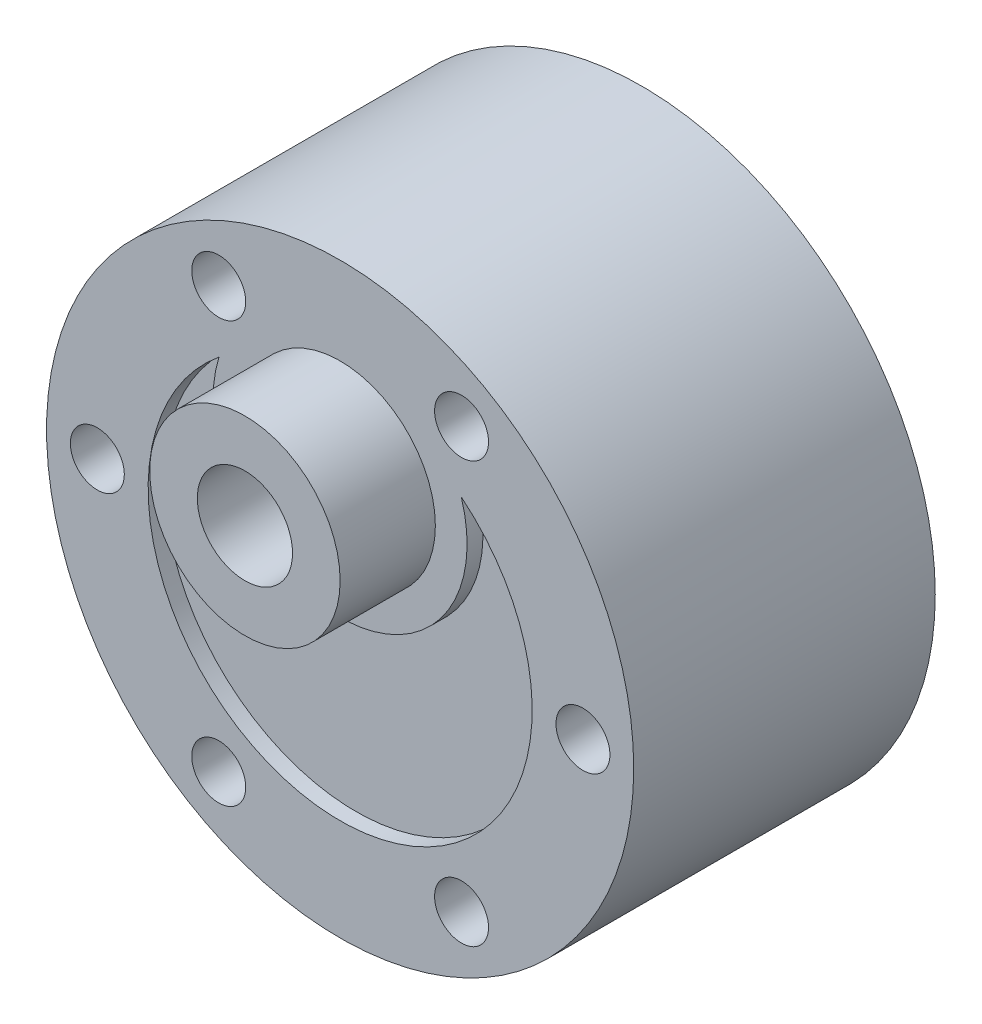
ISO-10303-21;
HEADER;
FILE_DESCRIPTION(('STEP AP214'),'2;1');
FILE_NAME('part.step','',(''),(''),'','','');
FILE_SCHEMA(('AUTOMOTIVE_DESIGN { 1 0 10303 214 1 1 1 1 }'));
ENDSEC;
DATA;
#1=APPLICATION_CONTEXT('core data for automotive mechanical design processes');
#2=APPLICATION_PROTOCOL_DEFINITION('international standard','automotive_design',2000,#1);
#3=PRODUCT_CONTEXT('',#1,'mechanical');
#4=PRODUCT('Part','Part','',(#3));
#5=PRODUCT_RELATED_PRODUCT_CATEGORY('part','',(#4));
#6=PRODUCT_DEFINITION_FORMATION('','',#4);
#7=PRODUCT_DEFINITION_CONTEXT('part definition',#1,'design');
#8=PRODUCT_DEFINITION('design','',#6,#7);
#9=PRODUCT_DEFINITION_SHAPE('','',#8);
#10=(LENGTH_UNIT() NAMED_UNIT(*) SI_UNIT(.MILLI.,.METRE.));
#11=(NAMED_UNIT(*) PLANE_ANGLE_UNIT() SI_UNIT($,.RADIAN.));
#12=(NAMED_UNIT(*) SI_UNIT($,.STERADIAN.) SOLID_ANGLE_UNIT());
#13=UNCERTAINTY_MEASURE_WITH_UNIT(LENGTH_MEASURE(1.E-05),#10,'distance_accuracy_value','');
#14=(GEOMETRIC_REPRESENTATION_CONTEXT(3) GLOBAL_UNCERTAINTY_ASSIGNED_CONTEXT((#13)) GLOBAL_UNIT_ASSIGNED_CONTEXT((#10,
#11,#12)) REPRESENTATION_CONTEXT('',''));
#15=CARTESIAN_POINT('',(0.,0.,0.));
#16=DIRECTION('',(0.,0.,1.));
#17=DIRECTION('',(1.,0.,0.));
#18=AXIS2_PLACEMENT_3D('',#15,#16,#17);
#19=CARTESIAN_POINT('',(0.,0.,12.));
#20=DIRECTION('',(0.,0.,-1.));
#21=DIRECTION('',(-1.,0.,0.));
#22=AXIS2_PLACEMENT_3D('',#19,#20,#21);
#23=CYLINDRICAL_SURFACE('',#22,18.);
#24=CARTESIAN_POINT('',(0.,0.,12.));
#25=DIRECTION('',(0.,0.,-1.));
#26=DIRECTION('',(-1.,0.,0.));
#27=AXIS2_PLACEMENT_3D('',#24,#25,#26);
#28=CIRCLE('',#27,18.);
#29=CARTESIAN_POINT('',(-18.,0.,12.));
#30=VERTEX_POINT('',#29);
#31=EDGE_CURVE('E133',#30,#30,#28,.T.);
#32=ORIENTED_EDGE('',*,*,#31,.F.);
#33=EDGE_LOOP('',(#32));
#34=FACE_BOUND('',#33,.T.);
#35=CARTESIAN_POINT('',(0.,0.,0.5));
#36=DIRECTION('',(0.,0.,-1.));
#37=DIRECTION('',(-1.,0.,0.));
#38=AXIS2_PLACEMENT_3D('',#35,#36,#37);
#39=CIRCLE('',#38,18.);
#40=CARTESIAN_POINT('',(-18.,0.,0.5));
#41=VERTEX_POINT('',#40);
#42=EDGE_CURVE('E42',#41,#41,#39,.F.);
#43=ORIENTED_EDGE('',*,*,#42,.F.);
#44=EDGE_LOOP('',(#43));
#45=FACE_BOUND('',#44,.T.);
#46=ADVANCED_FACE('F34',(#34,#45),#23,.F.);
#47=CARTESIAN_POINT('',(15.3,-1.57973634173914E-13,13.));
#48=DIRECTION('',(0.,0.,1.));
#49=DIRECTION('',(1.,0.,0.));
#50=AXIS2_PLACEMENT_3D('',#47,#48,#49);
#51=CONICAL_SURFACE('',#50,1.69999999999999,1.02974425867665);
#52=CARTESIAN_POINT('',(15.3,-1.57973634173914E-13,13.));
#53=DIRECTION('',(0.,0.,1.));
#54=DIRECTION('',(1.,0.,0.));
#55=AXIS2_PLACEMENT_3D('',#52,#53,#54);
#56=CIRCLE('',#55,1.69999999999999);
#57=CARTESIAN_POINT('',(17.,-1.57973634173914E-13,13.));
#58=VERTEX_POINT('',#57);
#59=EDGE_CURVE('E181',#58,#58,#56,.T.);
#60=ORIENTED_EDGE('',*,*,#59,.T.);
#61=EDGE_LOOP('',(#60));
#62=FACE_BOUND('',#61,.T.);
#63=CARTESIAN_POINT('',(15.3,-1.57973634173914E-13,12.));
#64=DIRECTION('',(0.,0.,-1.));
#65=DIRECTION('',(-1.,0.,0.));
#66=AXIS2_PLACEMENT_3D('',#63,#64,#65);
#67=CIRCLE('',#66,0.0357205176494769);
#68=CARTESIAN_POINT('',(15.2642794823505,-1.57973634173914E-13,12.));
#69=VERTEX_POINT('',#68);
#70=EDGE_CURVE('E151',#69,#69,#67,.F.);
#71=ORIENTED_EDGE('',*,*,#70,.F.);
#72=EDGE_LOOP('',(#71));
#73=FACE_BOUND('',#72,.T.);
#74=ADVANCED_FACE('F251',(#62,#73),#51,.F.);
#75=CARTESIAN_POINT('',(-7.65000000000012,13.2501886779018,13.));
#76=DIRECTION('',(0.,0.,1.));
#77=DIRECTION('',(1.,0.,0.));
#78=AXIS2_PLACEMENT_3D('',#75,#76,#77);
#79=CONICAL_SURFACE('',#78,1.69999999999999,1.02974425867665);
#80=CARTESIAN_POINT('',(-7.65000000000012,13.2501886779018,13.));
#81=DIRECTION('',(0.,0.,1.));
#82=DIRECTION('',(1.,0.,0.));
#83=AXIS2_PLACEMENT_3D('',#80,#81,#82);
#84=CIRCLE('',#83,1.69999999999999);
#85=CARTESIAN_POINT('',(-5.95000000000013,13.2501886779018,13.));
#86=VERTEX_POINT('',#85);
#87=EDGE_CURVE('E175',#86,#86,#84,.T.);
#88=ORIENTED_EDGE('',*,*,#87,.T.);
#89=EDGE_LOOP('',(#88));
#90=FACE_BOUND('',#89,.T.);
#91=CARTESIAN_POINT('',(-7.65000000000012,13.2501886779018,12.));
#92=DIRECTION('',(0.,0.,-1.));
#93=DIRECTION('',(-1.,0.,0.));
#94=AXIS2_PLACEMENT_3D('',#91,#92,#93);
#95=CIRCLE('',#94,0.0357205176494769);
#96=CARTESIAN_POINT('',(-7.6857205176496,13.2501886779018,12.));
#97=VERTEX_POINT('',#96);
#98=EDGE_CURVE('E148',#97,#97,#95,.F.);
#99=ORIENTED_EDGE('',*,*,#98,.F.);
#100=EDGE_LOOP('',(#99));
#101=FACE_BOUND('',#100,.T.);
#102=ADVANCED_FACE('F257',(#90,#101),#79,.F.);
#103=CARTESIAN_POINT('',(-15.3,0.,13.));
#104=DIRECTION('',(0.,0.,1.));
#105=DIRECTION('',(1.,0.,0.));
#106=AXIS2_PLACEMENT_3D('',#103,#104,#105);
#107=CONICAL_SURFACE('',#106,1.69999999999999,1.02974425867665);
#108=CARTESIAN_POINT('',(-15.3,0.,13.));
#109=DIRECTION('',(0.,0.,1.));
#110=DIRECTION('',(1.,0.,0.));
#111=AXIS2_PLACEMENT_3D('',#108,#109,#110);
#112=CIRCLE('',#111,1.69999999999999);
#113=CARTESIAN_POINT('',(-13.6,0.,13.));
#114=VERTEX_POINT('',#113);
#115=EDGE_CURVE('E169',#114,#114,#112,.T.);
#116=ORIENTED_EDGE('',*,*,#115,.T.);
#117=EDGE_LOOP('',(#116));
#118=FACE_BOUND('',#117,.T.);
#119=CARTESIAN_POINT('',(-15.3,0.,12.));
#120=DIRECTION('',(0.,0.,-1.));
#121=DIRECTION('',(-1.,0.,0.));
#122=AXIS2_PLACEMENT_3D('',#119,#120,#121);
#123=CIRCLE('',#122,0.0357205176494769);
#124=CARTESIAN_POINT('',(-15.3357205176495,0.,12.));
#125=VERTEX_POINT('',#124);
#126=EDGE_CURVE('E145',#125,#125,#123,.F.);
#127=ORIENTED_EDGE('',*,*,#126,.F.);
#128=EDGE_LOOP('',(#127));
#129=FACE_BOUND('',#128,.T.);
#130=ADVANCED_FACE('F282',(#118,#129),#107,.F.);
#131=CARTESIAN_POINT('',(-7.64999999999992,-13.250188677902,13.));
#132=DIRECTION('',(0.,0.,1.));
#133=DIRECTION('',(1.,0.,0.));
#134=AXIS2_PLACEMENT_3D('',#131,#132,#133);
#135=CONICAL_SURFACE('',#134,1.69999999999999,1.02974425867665);
#136=CARTESIAN_POINT('',(-7.64999999999992,-13.250188677902,13.));
#137=DIRECTION('',(0.,0.,1.));
#138=DIRECTION('',(1.,0.,0.));
#139=AXIS2_PLACEMENT_3D('',#136,#137,#138);
#140=CIRCLE('',#139,1.69999999999999);
#141=CARTESIAN_POINT('',(-5.94999999999992,-13.250188677902,13.));
#142=VERTEX_POINT('',#141);
#143=EDGE_CURVE('E163',#142,#142,#140,.T.);
#144=ORIENTED_EDGE('',*,*,#143,.T.);
#145=EDGE_LOOP('',(#144));
#146=FACE_BOUND('',#145,.T.);
#147=CARTESIAN_POINT('',(-7.64999999999992,-13.250188677902,12.));
#148=DIRECTION('',(0.,0.,-1.));
#149=DIRECTION('',(-1.,0.,0.));
#150=AXIS2_PLACEMENT_3D('',#147,#148,#149);
#151=CIRCLE('',#150,0.0357205176494769);
#152=CARTESIAN_POINT('',(-7.68572051764939,-13.250188677902,12.));
#153=VERTEX_POINT('',#152);
#154=EDGE_CURVE('E142',#153,#153,#151,.F.);
#155=ORIENTED_EDGE('',*,*,#154,.F.);
#156=EDGE_LOOP('',(#155));
#157=FACE_BOUND('',#156,.T.);
#158=ADVANCED_FACE('F274',(#146,#157),#135,.F.);
#159=CARTESIAN_POINT('',(7.64999999999992,-13.250188677902,13.));
#160=DIRECTION('',(0.,0.,1.));
#161=DIRECTION('',(1.,0.,0.));
#162=AXIS2_PLACEMENT_3D('',#159,#160,#161);
#163=CONICAL_SURFACE('',#162,1.69999999999999,1.02974425867665);
#164=CARTESIAN_POINT('',(7.64999999999992,-13.250188677902,13.));
#165=DIRECTION('',(0.,0.,1.));
#166=DIRECTION('',(1.,0.,0.));
#167=AXIS2_PLACEMENT_3D('',#164,#165,#166);
#168=CIRCLE('',#167,1.69999999999999);
#169=CARTESIAN_POINT('',(9.34999999999992,-13.250188677902,13.));
#170=VERTEX_POINT('',#169);
#171=EDGE_CURVE('E157',#170,#170,#168,.T.);
#172=ORIENTED_EDGE('',*,*,#171,.T.);
#173=EDGE_LOOP('',(#172));
#174=FACE_BOUND('',#173,.T.);
#175=CARTESIAN_POINT('',(7.64999999999992,-13.250188677902,12.));
#176=DIRECTION('',(0.,0.,-1.));
#177=DIRECTION('',(-1.,0.,0.));
#178=AXIS2_PLACEMENT_3D('',#175,#176,#177);
#179=CIRCLE('',#178,0.0357205176494769);
#180=CARTESIAN_POINT('',(7.61427948235045,-13.250188677902,12.));
#181=VERTEX_POINT('',#180);
#182=EDGE_CURVE('E141',#181,#181,#179,.F.);
#183=ORIENTED_EDGE('',*,*,#182,.F.);
#184=EDGE_LOOP('',(#183));
#185=FACE_BOUND('',#184,.T.);
#186=ADVANCED_FACE('F271',(#174,#185),#163,.F.);
#187=CARTESIAN_POINT('',(0.,0.,19.));
#188=DIRECTION('',(0.,0.,-1.));
#189=DIRECTION('',(-1.,0.,0.));
#190=AXIS2_PLACEMENT_3D('',#187,#188,#189);
#191=CYLINDRICAL_SURFACE('',#190,18.5);
#192=CARTESIAN_POINT('',(0.,0.,19.));
#193=DIRECTION('',(0.,0.,1.));
#194=DIRECTION('',(1.,0.,0.));
#195=AXIS2_PLACEMENT_3D('',#192,#193,#194);
#196=CIRCLE('',#195,18.5);
#197=CARTESIAN_POINT('',(18.5,0.,19.));
#198=VERTEX_POINT('',#197);
#199=EDGE_CURVE('E208',#198,#198,#196,.T.);
#200=ORIENTED_EDGE('',*,*,#199,.F.);
#201=EDGE_LOOP('',(#200));
#202=FACE_BOUND('',#201,.T.);
#203=CARTESIAN_POINT('',(0.,0.,0.));
#204=DIRECTION('',(0.,0.,1.));
#205=DIRECTION('',(1.,0.,0.));
#206=AXIS2_PLACEMENT_3D('',#203,#204,#205);
#207=CIRCLE('',#206,18.5);
#208=CARTESIAN_POINT('',(18.5,0.,0.));
#209=VERTEX_POINT('',#208);
#210=EDGE_CURVE('E205',#209,#209,#207,.T.);
#211=ORIENTED_EDGE('',*,*,#210,.T.);
#212=EDGE_LOOP('',(#211));
#213=FACE_BOUND('',#212,.T.);
#214=ADVANCED_FACE('F36',(#202,#213),#191,.T.);
#215=CARTESIAN_POINT('',(0.,0.,19.));
#216=DIRECTION('',(0.,0.,1.));
#217=DIRECTION('',(1.,0.,0.));
#218=AXIS2_PLACEMENT_3D('',#215,#216,#217);
#219=PLANE('',#218);
#220=CARTESIAN_POINT('',(7.64999999999992,-13.250188677902,19.));
#221=DIRECTION('',(0.,0.,1.));
#222=DIRECTION('',(1.,0.,0.));
#223=AXIS2_PLACEMENT_3D('',#220,#221,#222);
#224=CIRCLE('',#223,1.69999999999999);
#225=CARTESIAN_POINT('',(9.34999999999991,-13.250188677902,19.));
#226=VERTEX_POINT('',#225);
#227=EDGE_CURVE('E154',#226,#226,#224,.T.);
#228=ORIENTED_EDGE('',*,*,#227,.F.);
#229=EDGE_LOOP('',(#228));
#230=FACE_BOUND('',#229,.T.);
#231=CARTESIAN_POINT('',(-7.64999999999992,-13.250188677902,19.));
#232=DIRECTION('',(0.,0.,1.));
#233=DIRECTION('',(1.,0.,0.));
#234=AXIS2_PLACEMENT_3D('',#231,#232,#233);
#235=CIRCLE('',#234,1.69999999999999);
#236=CARTESIAN_POINT('',(-5.94999999999993,-13.250188677902,19.));
#237=VERTEX_POINT('',#236);
#238=EDGE_CURVE('E160',#237,#237,#235,.T.);
#239=ORIENTED_EDGE('',*,*,#238,.F.);
#240=EDGE_LOOP('',(#239));
#241=FACE_BOUND('',#240,.T.);
#242=CARTESIAN_POINT('',(-15.3,0.,19.));
#243=DIRECTION('',(0.,0.,1.));
#244=DIRECTION('',(1.,0.,0.));
#245=AXIS2_PLACEMENT_3D('',#242,#243,#244);
#246=CIRCLE('',#245,1.69999999999999);
#247=CARTESIAN_POINT('',(-13.6,0.,19.));
#248=VERTEX_POINT('',#247);
#249=EDGE_CURVE('E166',#248,#248,#246,.T.);
#250=ORIENTED_EDGE('',*,*,#249,.F.);
#251=EDGE_LOOP('',(#250));
#252=FACE_BOUND('',#251,.T.);
#253=CARTESIAN_POINT('',(-7.65000000000012,13.2501886779018,19.));
#254=DIRECTION('',(0.,0.,1.));
#255=DIRECTION('',(1.,0.,0.));
#256=AXIS2_PLACEMENT_3D('',#253,#254,#255);
#257=CIRCLE('',#256,1.69999999999999);
#258=CARTESIAN_POINT('',(-5.95000000000013,13.2501886779018,19.));
#259=VERTEX_POINT('',#258);
#260=EDGE_CURVE('E172',#259,#259,#257,.T.);
#261=ORIENTED_EDGE('',*,*,#260,.F.);
#262=EDGE_LOOP('',(#261));
#263=FACE_BOUND('',#262,.T.);
#264=CARTESIAN_POINT('',(15.3,-1.57973634173914E-13,19.));
#265=DIRECTION('',(0.,0.,1.));
#266=DIRECTION('',(1.,0.,0.));
#267=AXIS2_PLACEMENT_3D('',#264,#265,#266);
#268=CIRCLE('',#267,1.69999999999999);
#269=CARTESIAN_POINT('',(17.,-1.57973634173914E-13,19.));
#270=VERTEX_POINT('',#269);
#271=EDGE_CURVE('E178',#270,#270,#268,.T.);
#272=ORIENTED_EDGE('',*,*,#271,.F.);
#273=EDGE_LOOP('',(#272));
#274=FACE_BOUND('',#273,.T.);
#275=CARTESIAN_POINT('',(7.6500000000001,13.2501886779019,19.));
#276=DIRECTION('',(0.,0.,1.));
#277=DIRECTION('',(1.,0.,0.));
#278=AXIS2_PLACEMENT_3D('',#275,#276,#277);
#279=CIRCLE('',#278,1.69999999999999);
#280=CARTESIAN_POINT('',(9.35000000000009,13.2501886779019,19.));
#281=VERTEX_POINT('',#280);
#282=EDGE_CURVE('E184',#281,#281,#279,.T.);
#283=ORIENTED_EDGE('',*,*,#282,.F.);
#284=EDGE_LOOP('',(#283));
#285=FACE_BOUND('',#284,.T.);
#286=CARTESIAN_POINT('',(0.,6.99999999999999,19.));
#287=DIRECTION('',(0.,0.,-1.));
#288=DIRECTION('',(1.,0.,0.));
#289=AXIS2_PLACEMENT_3D('',#286,#287,#288);
#290=CIRCLE('',#289,8.00000000000002);
#291=CARTESIAN_POINT('',(7.63576837479172,9.38642857142863,19.));
#292=VERTEX_POINT('',#291);
#293=CARTESIAN_POINT('',(-7.63576837479172,9.38642857142863,19.));
#294=VERTEX_POINT('',#293);
#295=EDGE_CURVE('E57',#292,#294,#290,.T.);
#296=ORIENTED_EDGE('',*,*,#295,.F.);
#297=CARTESIAN_POINT('',(0.,0.,19.));
#298=DIRECTION('',(0.,0.,1.));
#299=DIRECTION('',(-1.,0.,0.));
#300=AXIS2_PLACEMENT_3D('',#297,#298,#299);
#301=CIRCLE('',#300,12.1000000000001);
#302=EDGE_CURVE('E191',#294,#292,#301,.T.);
#303=ORIENTED_EDGE('',*,*,#302,.F.);
#304=EDGE_LOOP('',(#296,#303));
#305=FACE_BOUND('',#304,.T.);
#306=CARTESIAN_POINT('',(0.,7.,19.));
#307=DIRECTION('',(0.,0.,1.));
#308=DIRECTION('',(1.,0.,0.));
#309=AXIS2_PLACEMENT_3D('',#306,#307,#308);
#310=CIRCLE('',#309,6.);
#311=CARTESIAN_POINT('',(6.,7.,19.));
#312=VERTEX_POINT('',#311);
#313=EDGE_CURVE('E200',#312,#312,#310,.T.);
#314=ORIENTED_EDGE('',*,*,#313,.F.);
#315=EDGE_LOOP('',(#314));
#316=FACE_BOUND('',#315,.T.);
#317=ORIENTED_EDGE('',*,*,#199,.T.);
#318=EDGE_LOOP('',(#317));
#319=FACE_BOUND('',#318,.T.);
#320=ADVANCED_FACE('F325',(#230,#241,#252,#263,#274,#285,#305,#316,#319),#219,.T.);
#321=CARTESIAN_POINT('',(0.,0.,0.));
#322=DIRECTION('',(0.,0.,1.));
#323=DIRECTION('',(1.,0.,0.));
#324=AXIS2_PLACEMENT_3D('',#321,#322,#323);
#325=PLANE('',#324);
#326=CARTESIAN_POINT('',(0.,0.,0.));
#327=DIRECTION('',(0.,0.,-1.));
#328=DIRECTION('',(-1.,0.,0.));
#329=AXIS2_PLACEMENT_3D('',#326,#327,#328);
#330=CIRCLE('',#329,6.);
#331=CARTESIAN_POINT('',(-6.,0.,0.));
#332=VERTEX_POINT('',#331);
#333=EDGE_CURVE('E113',#332,#332,#330,.T.);
#334=ORIENTED_EDGE('',*,*,#333,.F.);
#335=EDGE_LOOP('',(#334));
#336=FACE_BOUND('',#335,.T.);
#337=DIRECTION('',(1.,0.,0.));
#338=VECTOR('',#337,1.);
#339=CARTESIAN_POINT('',(6.24999999999999,-14.25,0.));
#340=LINE('',#339,#338);
#341=CARTESIAN_POINT('',(-6.25000000000001,-14.25,0.));
#342=VERTEX_POINT('',#341);
#343=CARTESIAN_POINT('',(6.24999999999999,-14.25,0.));
#344=VERTEX_POINT('',#343);
#345=EDGE_CURVE('E119',#342,#344,#340,.T.);
#346=ORIENTED_EDGE('',*,*,#345,.F.);
#347=DIRECTION('',(0.,1.,0.));
#348=VECTOR('',#347,1.);
#349=CARTESIAN_POINT('',(-6.25000000000001,-14.25,0.));
#350=LINE('',#349,#348);
#351=CARTESIAN_POINT('',(-6.25000000000001,-15.75,0.));
#352=VERTEX_POINT('',#351);
#353=EDGE_CURVE('E49',#352,#342,#350,.T.);
#354=ORIENTED_EDGE('',*,*,#353,.F.);
#355=DIRECTION('',(-1.,0.,0.));
#356=VECTOR('',#355,1.);
#357=CARTESIAN_POINT('',(6.24999999999999,-15.75,0.));
#358=LINE('',#357,#356);
#359=CARTESIAN_POINT('',(6.24999999999999,-15.75,0.));
#360=VERTEX_POINT('',#359);
#361=EDGE_CURVE('E107',#360,#352,#358,.T.);
#362=ORIENTED_EDGE('',*,*,#361,.F.);
#363=DIRECTION('',(0.,-1.,0.));
#364=VECTOR('',#363,1.);
#365=CARTESIAN_POINT('',(6.24999999999999,-14.25,0.));
#366=LINE('',#365,#364);
#367=EDGE_CURVE('E110',#344,#360,#366,.T.);
#368=ORIENTED_EDGE('',*,*,#367,.F.);
#369=EDGE_LOOP('',(#346,#354,#362,#368));
#370=FACE_BOUND('',#369,.T.);
#371=ORIENTED_EDGE('',*,*,#210,.F.);
#372=EDGE_LOOP('',(#371));
#373=FACE_BOUND('',#372,.T.);
#374=ADVANCED_FACE('F323',(#336,#370,#373),#325,.F.);
#375=CARTESIAN_POINT('',(0.,7.,25.));
#376=DIRECTION('',(0.,0.,-1.));
#377=DIRECTION('',(-1.,0.,0.));
#378=AXIS2_PLACEMENT_3D('',#375,#376,#377);
#379=CYLINDRICAL_SURFACE('',#378,6.);
#380=CARTESIAN_POINT('',(0.,7.,25.));
#381=DIRECTION('',(0.,0.,1.));
#382=DIRECTION('',(1.,0.,0.));
#383=AXIS2_PLACEMENT_3D('',#380,#381,#382);
#384=CIRCLE('',#383,6.);
#385=CARTESIAN_POINT('',(6.,7.,25.));
#386=VERTEX_POINT('',#385);
#387=EDGE_CURVE('E202',#386,#386,#384,.T.);
#388=ORIENTED_EDGE('',*,*,#387,.F.);
#389=EDGE_LOOP('',(#388));
#390=FACE_BOUND('',#389,.T.);
#391=ORIENTED_EDGE('',*,*,#313,.T.);
#392=EDGE_LOOP('',(#391));
#393=FACE_BOUND('',#392,.T.);
#394=ADVANCED_FACE('F319',(#390,#393),#379,.T.);
#395=CARTESIAN_POINT('',(0.,7.,25.));
#396=DIRECTION('',(0.,0.,1.));
#397=DIRECTION('',(1.,0.,0.));
#398=AXIS2_PLACEMENT_3D('',#395,#396,#397);
#399=PLANE('',#398);
#400=CARTESIAN_POINT('',(0.,7.,25.));
#401=DIRECTION('',(0.,0.,1.));
#402=DIRECTION('',(1.,0.,0.));
#403=AXIS2_PLACEMENT_3D('',#400,#401,#402);
#404=CIRCLE('',#403,3.);
#405=CARTESIAN_POINT('',(3.,7.,25.));
#406=VERTEX_POINT('',#405);
#407=EDGE_CURVE('E130',#406,#406,#404,.T.);
#408=ORIENTED_EDGE('',*,*,#407,.F.);
#409=EDGE_LOOP('',(#408));
#410=FACE_BOUND('',#409,.T.);
#411=ORIENTED_EDGE('',*,*,#387,.T.);
#412=EDGE_LOOP('',(#411));
#413=FACE_BOUND('',#412,.T.);
#414=ADVANCED_FACE('F316',(#410,#413),#399,.T.);
#415=CARTESIAN_POINT('',(0.,6.99999999999999,18.));
#416=DIRECTION('',(0.,0.,1.));
#417=DIRECTION('',(1.,0.,0.));
#418=AXIS2_PLACEMENT_3D('',#415,#416,#417);
#419=CYLINDRICAL_SURFACE('',#418,8.00000000000002);
#420=ORIENTED_EDGE('',*,*,#295,.T.);
#421=DIRECTION('',(0.,0.,1.));
#422=VECTOR('',#421,1.);
#423=CARTESIAN_POINT('',(-7.63576837479172,9.38642857142863,18.));
#424=LINE('',#423,#422);
#425=CARTESIAN_POINT('',(-7.63576837479172,9.38642857142863,18.));
#426=VERTEX_POINT('',#425);
#427=EDGE_CURVE('E194',#426,#294,#424,.T.);
#428=ORIENTED_EDGE('',*,*,#427,.F.);
#429=CARTESIAN_POINT('',(0.,6.99999999999999,18.));
#430=DIRECTION('',(0.,0.,-1.));
#431=DIRECTION('',(1.,0.,0.));
#432=AXIS2_PLACEMENT_3D('',#429,#430,#431);
#433=CIRCLE('',#432,8.00000000000002);
#434=CARTESIAN_POINT('',(7.63576837479172,9.38642857142863,18.));
#435=VERTEX_POINT('',#434);
#436=EDGE_CURVE('E187',#435,#426,#433,.T.);
#437=ORIENTED_EDGE('',*,*,#436,.F.);
#438=DIRECTION('',(0.,0.,1.));
#439=VECTOR('',#438,1.);
#440=CARTESIAN_POINT('',(7.63576837479172,9.38642857142863,18.));
#441=LINE('',#440,#439);
#442=EDGE_CURVE('E198',#435,#292,#441,.T.);
#443=ORIENTED_EDGE('',*,*,#442,.T.);
#444=EDGE_LOOP('',(#420,#428,#437,#443));
#445=FACE_BOUND('',#444,.T.);
#446=ADVANCED_FACE('F312',(#445),#419,.T.);
#447=CARTESIAN_POINT('',(0.,0.,18.));
#448=DIRECTION('',(0.,0.,1.));
#449=DIRECTION('',(1.,0.,0.));
#450=AXIS2_PLACEMENT_3D('',#447,#448,#449);
#451=CYLINDRICAL_SURFACE('',#450,12.1000000000001);
#452=ORIENTED_EDGE('',*,*,#302,.T.);
#453=ORIENTED_EDGE('',*,*,#442,.F.);
#454=CARTESIAN_POINT('',(0.,0.,18.));
#455=DIRECTION('',(0.,0.,1.));
#456=DIRECTION('',(-1.,0.,0.));
#457=AXIS2_PLACEMENT_3D('',#454,#455,#456);
#458=CIRCLE('',#457,12.1000000000001);
#459=EDGE_CURVE('E190',#426,#435,#458,.T.);
#460=ORIENTED_EDGE('',*,*,#459,.F.);
#461=ORIENTED_EDGE('',*,*,#427,.T.);
#462=EDGE_LOOP('',(#452,#453,#460,#461));
#463=FACE_BOUND('',#462,.T.);
#464=ADVANCED_FACE('F308',(#463),#451,.F.);
#465=CARTESIAN_POINT('',(0.,3.49999999999996,18.));
#466=DIRECTION('',(0.,0.,1.));
#467=DIRECTION('',(1.,0.,0.));
#468=AXIS2_PLACEMENT_3D('',#465,#466,#467);
#469=PLANE('',#468);
#470=ORIENTED_EDGE('',*,*,#436,.T.);
#471=ORIENTED_EDGE('',*,*,#459,.T.);
#472=EDGE_LOOP('',(#470,#471));
#473=FACE_BOUND('',#472,.T.);
#474=ADVANCED_FACE('F304',(#473),#469,.T.);
#475=CARTESIAN_POINT('',(7.6500000000001,13.2501886779019,19.));
#476=DIRECTION('',(0.,0.,1.));
#477=DIRECTION('',(1.,0.,0.));
#478=AXIS2_PLACEMENT_3D('',#475,#476,#477);
#479=CYLINDRICAL_SURFACE('',#478,1.69999999999999);
#480=ORIENTED_EDGE('',*,*,#282,.T.);
#481=EDGE_LOOP('',(#480));
#482=FACE_BOUND('',#481,.T.);
#483=CARTESIAN_POINT('',(7.6500000000001,13.2501886779019,12.));
#484=DIRECTION('',(0.,0.,-1.));
#485=DIRECTION('',(-1.,0.,0.));
#486=AXIS2_PLACEMENT_3D('',#483,#484,#485);
#487=CIRCLE('',#486,1.69999999999999);
#488=CARTESIAN_POINT('',(5.95000000000011,13.2501886779019,12.));
#489=VERTEX_POINT('',#488);
#490=EDGE_CURVE('E126',#489,#489,#487,.F.);
#491=ORIENTED_EDGE('',*,*,#490,.F.);
#492=EDGE_LOOP('',(#491));
#493=FACE_BOUND('',#492,.T.);
#494=ADVANCED_FACE('F299',(#482,#493),#479,.F.);
#495=CARTESIAN_POINT('',(15.3,-1.57973634173914E-13,19.));
#496=DIRECTION('',(0.,0.,1.));
#497=DIRECTION('',(1.,0.,0.));
#498=AXIS2_PLACEMENT_3D('',#495,#496,#497);
#499=CYLINDRICAL_SURFACE('',#498,1.69999999999999);
#500=ORIENTED_EDGE('',*,*,#59,.F.);
#501=EDGE_LOOP('',(#500));
#502=FACE_BOUND('',#501,.T.);
#503=ORIENTED_EDGE('',*,*,#271,.T.);
#504=EDGE_LOOP('',(#503));
#505=FACE_BOUND('',#504,.T.);
#506=ADVANCED_FACE('F293',(#502,#505),#499,.F.);
#507=CARTESIAN_POINT('',(-7.65000000000012,13.2501886779018,19.));
#508=DIRECTION('',(0.,0.,1.));
#509=DIRECTION('',(1.,0.,0.));
#510=AXIS2_PLACEMENT_3D('',#507,#508,#509);
#511=CYLINDRICAL_SURFACE('',#510,1.69999999999999);
#512=ORIENTED_EDGE('',*,*,#87,.F.);
#513=EDGE_LOOP('',(#512));
#514=FACE_BOUND('',#513,.T.);
#515=ORIENTED_EDGE('',*,*,#260,.T.);
#516=EDGE_LOOP('',(#515));
#517=FACE_BOUND('',#516,.T.);
#518=ADVANCED_FACE('F286',(#514,#517),#511,.F.);
#519=CARTESIAN_POINT('',(-15.3,0.,19.));
#520=DIRECTION('',(0.,0.,1.));
#521=DIRECTION('',(1.,0.,0.));
#522=AXIS2_PLACEMENT_3D('',#519,#520,#521);
#523=CYLINDRICAL_SURFACE('',#522,1.69999999999999);
#524=ORIENTED_EDGE('',*,*,#115,.F.);
#525=EDGE_LOOP('',(#524));
#526=FACE_BOUND('',#525,.T.);
#527=ORIENTED_EDGE('',*,*,#249,.T.);
#528=EDGE_LOOP('',(#527));
#529=FACE_BOUND('',#528,.T.);
#530=ADVANCED_FACE('F278',(#526,#529),#523,.F.);
#531=CARTESIAN_POINT('',(-7.64999999999992,-13.250188677902,19.));
#532=DIRECTION('',(0.,0.,1.));
#533=DIRECTION('',(1.,0.,0.));
#534=AXIS2_PLACEMENT_3D('',#531,#532,#533);
#535=CYLINDRICAL_SURFACE('',#534,1.69999999999999);
#536=ORIENTED_EDGE('',*,*,#143,.F.);
#537=EDGE_LOOP('',(#536));
#538=FACE_BOUND('',#537,.T.);
#539=ORIENTED_EDGE('',*,*,#238,.T.);
#540=EDGE_LOOP('',(#539));
#541=FACE_BOUND('',#540,.T.);
#542=ADVANCED_FACE('F269',(#538,#541),#535,.F.);
#543=CARTESIAN_POINT('',(7.64999999999992,-13.250188677902,19.));
#544=DIRECTION('',(0.,0.,1.));
#545=DIRECTION('',(1.,0.,0.));
#546=AXIS2_PLACEMENT_3D('',#543,#544,#545);
#547=CYLINDRICAL_SURFACE('',#546,1.69999999999999);
#548=ORIENTED_EDGE('',*,*,#171,.F.);
#549=EDGE_LOOP('',(#548));
#550=FACE_BOUND('',#549,.T.);
#551=ORIENTED_EDGE('',*,*,#227,.T.);
#552=EDGE_LOOP('',(#551));
#553=FACE_BOUND('',#552,.T.);
#554=ADVANCED_FACE('F266',(#550,#553),#547,.F.);
#555=CARTESIAN_POINT('',(0.,0.,12.));
#556=DIRECTION('',(0.,0.,-1.));
#557=DIRECTION('',(-1.,0.,0.));
#558=AXIS2_PLACEMENT_3D('',#555,#556,#557);
#559=PLANE('',#558);
#560=CARTESIAN_POINT('',(0.,-5.15,12.));
#561=DIRECTION('',(0.,0.,-1.));
#562=DIRECTION('',(-1.,0.,0.));
#563=AXIS2_PLACEMENT_3D('',#560,#561,#562);
#564=CIRCLE('',#563,2.25);
#565=CARTESIAN_POINT('',(-2.25,-5.15,12.));
#566=VERTEX_POINT('',#565);
#567=EDGE_CURVE('E224',#566,#566,#564,.T.);
#568=ORIENTED_EDGE('',*,*,#567,.F.);
#569=EDGE_LOOP('',(#568));
#570=FACE_BOUND('',#569,.T.);
#571=CARTESIAN_POINT('',(0.,7.,12.));
#572=DIRECTION('',(0.,0.,-1.));
#573=DIRECTION('',(-1.,0.,0.));
#574=AXIS2_PLACEMENT_3D('',#571,#572,#573);
#575=CIRCLE('',#574,3.);
#576=CARTESIAN_POINT('',(-3.,7.,12.));
#577=VERTEX_POINT('',#576);
#578=EDGE_CURVE('E134',#577,#577,#575,.F.);
#579=ORIENTED_EDGE('',*,*,#578,.T.);
#580=EDGE_LOOP('',(#579));
#581=FACE_BOUND('',#580,.T.);
#582=ORIENTED_EDGE('',*,*,#490,.T.);
#583=EDGE_LOOP('',(#582));
#584=FACE_BOUND('',#583,.T.);
#585=ORIENTED_EDGE('',*,*,#31,.T.);
#586=EDGE_LOOP('',(#585));
#587=FACE_BOUND('',#586,.T.);
#588=ORIENTED_EDGE('',*,*,#182,.T.);
#589=EDGE_LOOP('',(#588));
#590=FACE_BOUND('',#589,.T.);
#591=ORIENTED_EDGE('',*,*,#154,.T.);
#592=EDGE_LOOP('',(#591));
#593=FACE_BOUND('',#592,.T.);
#594=ORIENTED_EDGE('',*,*,#126,.T.);
#595=EDGE_LOOP('',(#594));
#596=FACE_BOUND('',#595,.T.);
#597=ORIENTED_EDGE('',*,*,#98,.T.);
#598=EDGE_LOOP('',(#597));
#599=FACE_BOUND('',#598,.T.);
#600=ORIENTED_EDGE('',*,*,#70,.T.);
#601=EDGE_LOOP('',(#600));
#602=FACE_BOUND('',#601,.T.);
#603=ADVANCED_FACE('F264',(#570,#581,#584,#587,#590,#593,#596,#599,#602),#559,.T.);
#604=CARTESIAN_POINT('',(0.,7.,-0.001000000000001));
#605=DIRECTION('',(0.,0.,1.));
#606=DIRECTION('',(1.,0.,0.));
#607=AXIS2_PLACEMENT_3D('',#604,#605,#606);
#608=CYLINDRICAL_SURFACE('',#607,3.);
#609=ORIENTED_EDGE('',*,*,#578,.F.);
#610=EDGE_LOOP('',(#609));
#611=FACE_BOUND('',#610,.T.);
#612=ORIENTED_EDGE('',*,*,#407,.T.);
#613=EDGE_LOOP('',(#612));
#614=FACE_BOUND('',#613,.T.);
#615=ADVANCED_FACE('F436',(#611,#614),#608,.F.);
#616=CARTESIAN_POINT('',(0.,0.,0.5));
#617=DIRECTION('',(0.,0.,-1.));
#618=DIRECTION('',(-1.,0.,0.));
#619=AXIS2_PLACEMENT_3D('',#616,#617,#618);
#620=PLANE('',#619);
#621=CARTESIAN_POINT('',(0.,0.,0.5));
#622=DIRECTION('',(0.,0.,-1.));
#623=DIRECTION('',(-1.,0.,0.));
#624=AXIS2_PLACEMENT_3D('',#621,#622,#623);
#625=CIRCLE('',#624,6.);
#626=CARTESIAN_POINT('',(-6.,0.,0.5));
#627=VERTEX_POINT('',#626);
#628=EDGE_CURVE('E120',#627,#627,#625,.T.);
#629=ORIENTED_EDGE('',*,*,#628,.T.);
#630=EDGE_LOOP('',(#629));
#631=FACE_BOUND('',#630,.T.);
#632=ORIENTED_EDGE('',*,*,#42,.T.);
#633=EDGE_LOOP('',(#632));
#634=FACE_BOUND('',#633,.T.);
#635=ADVANCED_FACE('F439',(#631,#634),#620,.F.);
#636=CARTESIAN_POINT('',(-6.25000000000001,-14.25,0.15));
#637=DIRECTION('',(-1.,0.,0.));
#638=DIRECTION('',(0.,-1.,0.));
#639=AXIS2_PLACEMENT_3D('',#636,#637,#638);
#640=PLANE('',#639);
#641=ORIENTED_EDGE('',*,*,#353,.T.);
#642=DIRECTION('',(0.,0.,-1.));
#643=VECTOR('',#642,1.);
#644=CARTESIAN_POINT('',(-6.25000000000001,-14.25,0.15));
#645=LINE('',#644,#643);
#646=CARTESIAN_POINT('',(-6.25000000000001,-14.25,0.15));
#647=VERTEX_POINT('',#646);
#648=EDGE_CURVE('E85',#647,#342,#645,.T.);
#649=ORIENTED_EDGE('',*,*,#648,.F.);
#650=DIRECTION('',(0.,1.,0.));
#651=VECTOR('',#650,1.);
#652=CARTESIAN_POINT('',(-6.25000000000001,-14.25,0.15));
#653=LINE('',#652,#651);
#654=CARTESIAN_POINT('',(-6.25000000000001,-15.75,0.15));
#655=VERTEX_POINT('',#654);
#656=EDGE_CURVE('E89',#655,#647,#653,.T.);
#657=ORIENTED_EDGE('',*,*,#656,.F.);
#658=DIRECTION('',(0.,0.,-1.));
#659=VECTOR('',#658,1.);
#660=CARTESIAN_POINT('',(-6.25000000000001,-15.75,0.15));
#661=LINE('',#660,#659);
#662=EDGE_CURVE('E124',#655,#352,#661,.T.);
#663=ORIENTED_EDGE('',*,*,#662,.T.);
#664=EDGE_LOOP('',(#641,#649,#657,#663));
#665=FACE_BOUND('',#664,.T.);
#666=ADVANCED_FACE('F87',(#665),#640,.F.);
#667=CARTESIAN_POINT('',(6.24999999999999,-15.75,0.15));
#668=DIRECTION('',(0.,-1.,0.));
#669=DIRECTION('',(0.,0.,-1.));
#670=AXIS2_PLACEMENT_3D('',#667,#668,#669);
#671=PLANE('',#670);
#672=ORIENTED_EDGE('',*,*,#361,.T.);
#673=ORIENTED_EDGE('',*,*,#662,.F.);
#674=DIRECTION('',(-1.,0.,0.));
#675=VECTOR('',#674,1.);
#676=CARTESIAN_POINT('',(6.24999999999999,-15.75,0.15));
#677=LINE('',#676,#675);
#678=CARTESIAN_POINT('',(6.24999999999999,-15.75,0.15));
#679=VERTEX_POINT('',#678);
#680=EDGE_CURVE('E95',#679,#655,#677,.T.);
#681=ORIENTED_EDGE('',*,*,#680,.F.);
#682=DIRECTION('',(0.,0.,-1.));
#683=VECTOR('',#682,1.);
#684=CARTESIAN_POINT('',(6.24999999999999,-15.75,0.15));
#685=LINE('',#684,#683);
#686=EDGE_CURVE('E127',#679,#360,#685,.T.);
#687=ORIENTED_EDGE('',*,*,#686,.T.);
#688=EDGE_LOOP('',(#672,#673,#681,#687));
#689=FACE_BOUND('',#688,.T.);
#690=ADVANCED_FACE('F455',(#689),#671,.F.);
#691=CARTESIAN_POINT('',(6.24999999999999,-14.25,0.15));
#692=DIRECTION('',(1.,0.,0.));
#693=DIRECTION('',(0.,1.,0.));
#694=AXIS2_PLACEMENT_3D('',#691,#692,#693);
#695=PLANE('',#694);
#696=ORIENTED_EDGE('',*,*,#367,.T.);
#697=ORIENTED_EDGE('',*,*,#686,.F.);
#698=DIRECTION('',(0.,-1.,0.));
#699=VECTOR('',#698,1.);
#700=CARTESIAN_POINT('',(6.24999999999999,-14.25,0.15));
#701=LINE('',#700,#699);
#702=CARTESIAN_POINT('',(6.24999999999999,-14.25,0.15));
#703=VERTEX_POINT('',#702);
#704=EDGE_CURVE('E103',#703,#679,#701,.T.);
#705=ORIENTED_EDGE('',*,*,#704,.F.);
#706=DIRECTION('',(0.,0.,-1.));
#707=VECTOR('',#706,1.);
#708=CARTESIAN_POINT('',(6.24999999999999,-14.25,0.15));
#709=LINE('',#708,#707);
#710=EDGE_CURVE('E94',#703,#344,#709,.T.);
#711=ORIENTED_EDGE('',*,*,#710,.T.);
#712=EDGE_LOOP('',(#696,#697,#705,#711));
#713=FACE_BOUND('',#712,.T.);
#714=ADVANCED_FACE('F465',(#713),#695,.F.);
#715=CARTESIAN_POINT('',(6.24999999999999,-14.25,0.15));
#716=DIRECTION('',(0.,1.,0.));
#717=DIRECTION('',(-1.,0.,0.));
#718=AXIS2_PLACEMENT_3D('',#715,#716,#717);
#719=PLANE('',#718);
#720=ORIENTED_EDGE('',*,*,#345,.T.);
#721=ORIENTED_EDGE('',*,*,#710,.F.);
#722=DIRECTION('',(1.,0.,0.));
#723=VECTOR('',#722,1.);
#724=CARTESIAN_POINT('',(6.24999999999999,-14.25,0.15));
#725=LINE('',#724,#723);
#726=EDGE_CURVE('E98',#647,#703,#725,.T.);
#727=ORIENTED_EDGE('',*,*,#726,.F.);
#728=ORIENTED_EDGE('',*,*,#648,.T.);
#729=EDGE_LOOP('',(#720,#721,#727,#728));
#730=FACE_BOUND('',#729,.T.);
#731=ADVANCED_FACE('F99',(#730),#719,.F.);
#732=CARTESIAN_POINT('',(0.,0.,0.15));
#733=DIRECTION('',(0.,0.,-1.));
#734=DIRECTION('',(-1.,0.,0.));
#735=AXIS2_PLACEMENT_3D('',#732,#733,#734);
#736=PLANE('',#735);
#737=ORIENTED_EDGE('',*,*,#656,.T.);
#738=ORIENTED_EDGE('',*,*,#726,.T.);
#739=ORIENTED_EDGE('',*,*,#704,.T.);
#740=ORIENTED_EDGE('',*,*,#680,.T.);
#741=EDGE_LOOP('',(#737,#738,#739,#740));
#742=FACE_BOUND('',#741,.T.);
#743=ADVANCED_FACE('F105',(#742),#736,.T.);
#744=CARTESIAN_POINT('',(0.,0.,10.));
#745=DIRECTION('',(0.,0.,-1.));
#746=DIRECTION('',(-1.,0.,0.));
#747=AXIS2_PLACEMENT_3D('',#744,#745,#746);
#748=CYLINDRICAL_SURFACE('',#747,6.);
#749=ORIENTED_EDGE('',*,*,#333,.T.);
#750=EDGE_LOOP('',(#749));
#751=FACE_BOUND('',#750,.T.);
#752=ORIENTED_EDGE('',*,*,#628,.F.);
#753=EDGE_LOOP('',(#752));
#754=FACE_BOUND('',#753,.T.);
#755=ADVANCED_FACE('F240',(#751,#754),#748,.F.);
#756=CARTESIAN_POINT('',(0.,-5.15,11.));
#757=DIRECTION('',(0.,0.,-1.));
#758=DIRECTION('',(-1.,0.,0.));
#759=AXIS2_PLACEMENT_3D('',#756,#757,#758);
#760=PLANE('',#759);
#761=CARTESIAN_POINT('',(0.,-5.15,11.));
#762=DIRECTION('',(0.,0.,-1.));
#763=DIRECTION('',(-1.,0.,0.));
#764=AXIS2_PLACEMENT_3D('',#761,#762,#763);
#765=CIRCLE('',#764,2.25);
#766=CARTESIAN_POINT('',(-2.25,-5.15,11.));
#767=VERTEX_POINT('',#766);
#768=EDGE_CURVE('E220',#767,#767,#765,.T.);
#769=ORIENTED_EDGE('',*,*,#768,.T.);
#770=EDGE_LOOP('',(#769));
#771=FACE_BOUND('',#770,.T.);
#772=CARTESIAN_POINT('',(0.,-5.15,11.));
#773=DIRECTION('',(0.,0.,-1.));
#774=DIRECTION('',(-1.,0.,0.));
#775=AXIS2_PLACEMENT_3D('',#772,#773,#774);
#776=CIRCLE('',#775,2.);
#777=CARTESIAN_POINT('',(-2.,-5.15,11.));
#778=VERTEX_POINT('',#777);
#779=EDGE_CURVE('E229',#778,#778,#776,.T.);
#780=ORIENTED_EDGE('',*,*,#779,.F.);
#781=EDGE_LOOP('',(#780));
#782=FACE_BOUND('',#781,.T.);
#783=ADVANCED_FACE('F237',(#771,#782),#760,.T.);
#784=CARTESIAN_POINT('',(0.,-5.15,11.));
#785=DIRECTION('',(0.,0.,1.));
#786=DIRECTION('',(1.,0.,0.));
#787=AXIS2_PLACEMENT_3D('',#784,#785,#786);
#788=CYLINDRICAL_SURFACE('',#787,2.25);
#789=ORIENTED_EDGE('',*,*,#768,.F.);
#790=EDGE_LOOP('',(#789));
#791=FACE_BOUND('',#790,.T.);
#792=ORIENTED_EDGE('',*,*,#567,.T.);
#793=EDGE_LOOP('',(#792));
#794=FACE_BOUND('',#793,.T.);
#795=ADVANCED_FACE('F239',(#791,#794),#788,.T.);
#796=CARTESIAN_POINT('',(0.,-5.15,11.));
#797=DIRECTION('',(0.,0.,1.));
#798=DIRECTION('',(1.,0.,0.));
#799=AXIS2_PLACEMENT_3D('',#796,#797,#798);
#800=CYLINDRICAL_SURFACE('',#799,2.);
#801=ORIENTED_EDGE('',*,*,#779,.T.);
#802=EDGE_LOOP('',(#801));
#803=FACE_BOUND('',#802,.T.);
#804=CARTESIAN_POINT('',(0.,-5.15,12.));
#805=DIRECTION('',(0.,0.,-1.));
#806=DIRECTION('',(-1.,0.,0.));
#807=AXIS2_PLACEMENT_3D('',#804,#805,#806);
#808=CIRCLE('',#807,2.);
#809=CARTESIAN_POINT('',(-2.,-5.15,12.));
#810=VERTEX_POINT('',#809);
#811=EDGE_CURVE('E11',#810,#810,#808,.F.);
#812=ORIENTED_EDGE('',*,*,#811,.T.);
#813=EDGE_LOOP('',(#812));
#814=FACE_BOUND('',#813,.T.);
#815=ADVANCED_FACE('F234',(#803,#814),#800,.F.);
#816=ORIENTED_EDGE('',*,*,#811,.F.);
#817=EDGE_LOOP('',(#816));
#818=FACE_BOUND('',#817,.T.);
#819=ADVANCED_FACE('F514',(#818),#559,.T.);
#820=CLOSED_SHELL('',(#46,#74,#102,#130,#158,#186,#214,#320,#374,#394,#414,#446,#464,#474,#494,
#506,#518,#530,#542,#554,#603,#615,#635,#666,#690,#714,#731,#743,#755,#783,#795,#815,#819));
#821=MANIFOLD_SOLID_BREP('B2',#820);
#822=ADVANCED_BREP_SHAPE_REPRESENTATION('',(#18,#821),#14);
#823=SHAPE_DEFINITION_REPRESENTATION(#9,#822);
ENDSEC;
END-ISO-10303-21;
